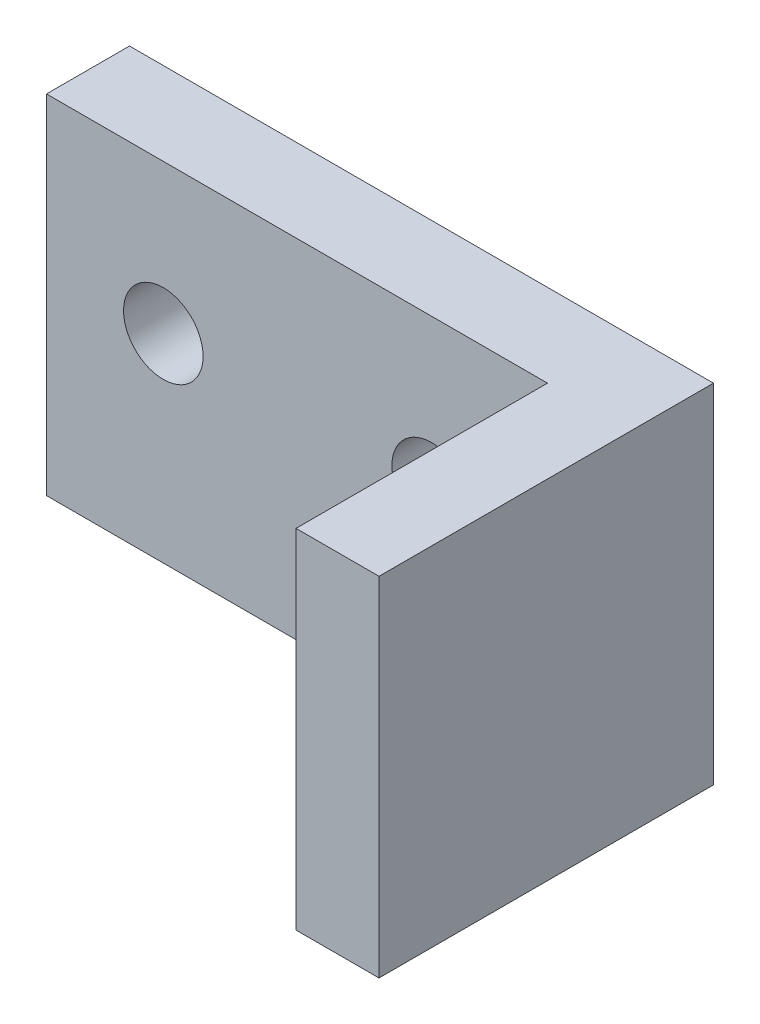
ISO-10303-21;
HEADER;
FILE_DESCRIPTION(('STEP AP214'),'2;1');
FILE_NAME('part.step','',(''),(''),'','','');
FILE_SCHEMA(('AUTOMOTIVE_DESIGN { 1 0 10303 214 1 1 1 1 }'));
ENDSEC;
DATA;
#1=APPLICATION_CONTEXT('core data for automotive mechanical design processes');
#2=APPLICATION_PROTOCOL_DEFINITION('international standard','automotive_design',2000,#1);
#3=PRODUCT_CONTEXT('',#1,'mechanical');
#4=PRODUCT('Part','Part','',(#3));
#5=PRODUCT_RELATED_PRODUCT_CATEGORY('part','',(#4));
#6=PRODUCT_DEFINITION_FORMATION('','',#4);
#7=PRODUCT_DEFINITION_CONTEXT('part definition',#1,'design');
#8=PRODUCT_DEFINITION('design','',#6,#7);
#9=PRODUCT_DEFINITION_SHAPE('','',#8);
#10=(LENGTH_UNIT() NAMED_UNIT(*) SI_UNIT(.MILLI.,.METRE.));
#11=(NAMED_UNIT(*) PLANE_ANGLE_UNIT() SI_UNIT($,.RADIAN.));
#12=(NAMED_UNIT(*) SI_UNIT($,.STERADIAN.) SOLID_ANGLE_UNIT());
#13=UNCERTAINTY_MEASURE_WITH_UNIT(LENGTH_MEASURE(1.E-05),#10,'distance_accuracy_value','');
#14=(GEOMETRIC_REPRESENTATION_CONTEXT(3) GLOBAL_UNCERTAINTY_ASSIGNED_CONTEXT((#13)) GLOBAL_UNIT_ASSIGNED_CONTEXT((#10,
#11,#12)) REPRESENTATION_CONTEXT('',''));
#15=CARTESIAN_POINT('',(0.,0.,0.));
#16=DIRECTION('',(0.,0.,1.));
#17=DIRECTION('',(1.,0.,0.));
#18=AXIS2_PLACEMENT_3D('',#15,#16,#17);
#19=CARTESIAN_POINT('',(25.15,205.,12.65));
#20=DIRECTION('',(1.,0.,0.));
#21=DIRECTION('',(0.,0.,-1.));
#22=AXIS2_PLACEMENT_3D('',#19,#20,#21);
#23=PLANE('',#22);
#24=DIRECTION('',(0.,0.,1.));
#25=VECTOR('',#24,1.);
#26=CARTESIAN_POINT('',(25.15,170.,12.65));
#27=LINE('',#26,#25);
#28=CARTESIAN_POINT('',(25.15,170.,-12.65));
#29=VERTEX_POINT('',#28);
#30=CARTESIAN_POINT('',(25.15,170.,12.65));
#31=VERTEX_POINT('',#30);
#32=EDGE_CURVE('E125',#29,#31,#27,.T.);
#33=ORIENTED_EDGE('',*,*,#32,.T.);
#34=DIRECTION('',(0.,-1.,0.));
#35=VECTOR('',#34,1.);
#36=CARTESIAN_POINT('',(25.15,205.,12.65));
#37=LINE('',#36,#35);
#38=CARTESIAN_POINT('',(25.15,205.,12.65));
#39=VERTEX_POINT('',#38);
#40=EDGE_CURVE('E11',#39,#31,#37,.T.);
#41=ORIENTED_EDGE('',*,*,#40,.F.);
#42=DIRECTION('',(0.,0.,1.));
#43=VECTOR('',#42,1.);
#44=CARTESIAN_POINT('',(25.15,205.,12.65));
#45=LINE('',#44,#43);
#46=CARTESIAN_POINT('',(25.15,205.,-12.65));
#47=VERTEX_POINT('',#46);
#48=EDGE_CURVE('E135',#47,#39,#45,.T.);
#49=ORIENTED_EDGE('',*,*,#48,.F.);
#50=DIRECTION('',(0.,-1.,0.));
#51=VECTOR('',#50,1.);
#52=CARTESIAN_POINT('',(25.15,205.,-12.65));
#53=LINE('',#52,#51);
#54=EDGE_CURVE('E121',#47,#29,#53,.T.);
#55=ORIENTED_EDGE('',*,*,#54,.T.);
#56=EDGE_LOOP('',(#33,#41,#49,#55));
#57=FACE_BOUND('',#56,.T.);
#58=ADVANCED_FACE('F39',(#57),#23,.F.);
#59=CARTESIAN_POINT('',(25.15,205.,12.65));
#60=DIRECTION('',(0.,0.,-1.));
#61=DIRECTION('',(-1.,0.,0.));
#62=AXIS2_PLACEMENT_3D('',#59,#60,#61);
#63=PLANE('',#62);
#64=DIRECTION('',(1.,0.,0.));
#65=VECTOR('',#64,1.);
#66=CARTESIAN_POINT('',(25.15,170.,12.65));
#67=LINE('',#66,#65);
#68=CARTESIAN_POINT('',(33.5,170.,12.65));
#69=VERTEX_POINT('',#68);
#70=EDGE_CURVE('E128',#31,#69,#67,.T.);
#71=ORIENTED_EDGE('',*,*,#70,.T.);
#72=DIRECTION('',(0.,-1.,0.));
#73=VECTOR('',#72,1.);
#74=CARTESIAN_POINT('',(33.5,205.,12.65));
#75=LINE('',#74,#73);
#76=CARTESIAN_POINT('',(33.5,205.,12.65));
#77=VERTEX_POINT('',#76);
#78=EDGE_CURVE('E48',#77,#69,#75,.T.);
#79=ORIENTED_EDGE('',*,*,#78,.F.);
#80=DIRECTION('',(1.,0.,0.));
#81=VECTOR('',#80,1.);
#82=CARTESIAN_POINT('',(25.15,205.,12.65));
#83=LINE('',#82,#81);
#84=EDGE_CURVE('E94',#39,#77,#83,.T.);
#85=ORIENTED_EDGE('',*,*,#84,.F.);
#86=ORIENTED_EDGE('',*,*,#40,.T.);
#87=EDGE_LOOP('',(#71,#79,#85,#86));
#88=FACE_BOUND('',#87,.T.);
#89=ADVANCED_FACE('F157',(#88),#63,.F.);
#90=CARTESIAN_POINT('',(33.5,205.,12.65));
#91=DIRECTION('',(-1.,0.,0.));
#92=DIRECTION('',(0.,0.,1.));
#93=AXIS2_PLACEMENT_3D('',#90,#91,#92);
#94=PLANE('',#93);
#95=DIRECTION('',(0.,0.,-1.));
#96=VECTOR('',#95,1.);
#97=CARTESIAN_POINT('',(33.5,170.,12.65));
#98=LINE('',#97,#96);
#99=CARTESIAN_POINT('',(33.5,170.,-21.));
#100=VERTEX_POINT('',#99);
#101=EDGE_CURVE('E130',#69,#100,#98,.T.);
#102=ORIENTED_EDGE('',*,*,#101,.T.);
#103=DIRECTION('',(0.,-1.,0.));
#104=VECTOR('',#103,1.);
#105=CARTESIAN_POINT('',(33.5,205.,-21.));
#106=LINE('',#105,#104);
#107=CARTESIAN_POINT('',(33.5,205.,-21.));
#108=VERTEX_POINT('',#107);
#109=EDGE_CURVE('E116',#108,#100,#106,.T.);
#110=ORIENTED_EDGE('',*,*,#109,.F.);
#111=DIRECTION('',(0.,0.,-1.));
#112=VECTOR('',#111,1.);
#113=CARTESIAN_POINT('',(33.5,205.,12.65));
#114=LINE('',#113,#112);
#115=EDGE_CURVE('E107',#77,#108,#114,.T.);
#116=ORIENTED_EDGE('',*,*,#115,.F.);
#117=ORIENTED_EDGE('',*,*,#78,.T.);
#118=EDGE_LOOP('',(#102,#110,#116,#117));
#119=FACE_BOUND('',#118,.T.);
#120=ADVANCED_FACE('F160',(#119),#94,.F.);
#121=CARTESIAN_POINT('',(33.5,205.,-21.));
#122=DIRECTION('',(0.,0.,1.));
#123=DIRECTION('',(1.,0.,0.));
#124=AXIS2_PLACEMENT_3D('',#121,#122,#123);
#125=PLANE('',#124);
#126=CARTESIAN_POINT('',(-13.5,190.,-21.));
#127=DIRECTION('',(0.,0.,1.));
#128=DIRECTION('',(1.,0.,0.));
#129=AXIS2_PLACEMENT_3D('',#126,#127,#128);
#130=CIRCLE('',#129,4.);
#131=CARTESIAN_POINT('',(-9.5,190.,-21.));
#132=VERTEX_POINT('',#131);
#133=EDGE_CURVE('E142',#132,#132,#130,.F.);
#134=ORIENTED_EDGE('',*,*,#133,.F.);
#135=EDGE_LOOP('',(#134));
#136=FACE_BOUND('',#135,.T.);
#137=CARTESIAN_POINT('',(13.5,190.,-21.));
#138=DIRECTION('',(0.,0.,1.));
#139=DIRECTION('',(1.,0.,0.));
#140=AXIS2_PLACEMENT_3D('',#137,#138,#139);
#141=CIRCLE('',#140,4.);
#142=CARTESIAN_POINT('',(17.5,190.,-21.));
#143=VERTEX_POINT('',#142);
#144=EDGE_CURVE('E147',#143,#143,#141,.F.);
#145=ORIENTED_EDGE('',*,*,#144,.F.);
#146=EDGE_LOOP('',(#145));
#147=FACE_BOUND('',#146,.T.);
#148=DIRECTION('',(-1.,0.,0.));
#149=VECTOR('',#148,1.);
#150=CARTESIAN_POINT('',(33.5,170.,-21.));
#151=LINE('',#150,#149);
#152=CARTESIAN_POINT('',(-25.25,170.,-21.));
#153=VERTEX_POINT('',#152);
#154=EDGE_CURVE('E115',#100,#153,#151,.T.);
#155=ORIENTED_EDGE('',*,*,#154,.T.);
#156=DIRECTION('',(0.,-1.,0.));
#157=VECTOR('',#156,1.);
#158=CARTESIAN_POINT('',(-25.25,205.,-21.));
#159=LINE('',#158,#157);
#160=CARTESIAN_POINT('',(-25.25,205.,-21.));
#161=VERTEX_POINT('',#160);
#162=EDGE_CURVE('E112',#161,#153,#159,.T.);
#163=ORIENTED_EDGE('',*,*,#162,.F.);
#164=DIRECTION('',(-1.,0.,0.));
#165=VECTOR('',#164,1.);
#166=CARTESIAN_POINT('',(33.5,205.,-21.));
#167=LINE('',#166,#165);
#168=EDGE_CURVE('E101',#108,#161,#167,.T.);
#169=ORIENTED_EDGE('',*,*,#168,.F.);
#170=ORIENTED_EDGE('',*,*,#109,.T.);
#171=EDGE_LOOP('',(#155,#163,#169,#170));
#172=FACE_BOUND('',#171,.T.);
#173=ADVANCED_FACE('F113',(#136,#147,#172),#125,.F.);
#174=CARTESIAN_POINT('',(-25.25,205.,-12.65));
#175=DIRECTION('',(1.,0.,0.));
#176=DIRECTION('',(0.,0.,-1.));
#177=AXIS2_PLACEMENT_3D('',#174,#175,#176);
#178=PLANE('',#177);
#179=DIRECTION('',(0.,0.,1.));
#180=VECTOR('',#179,1.);
#181=CARTESIAN_POINT('',(-25.25,170.,-12.65));
#182=LINE('',#181,#180);
#183=CARTESIAN_POINT('',(-25.25,170.,-12.65));
#184=VERTEX_POINT('',#183);
#185=EDGE_CURVE('E80',#153,#184,#182,.T.);
#186=ORIENTED_EDGE('',*,*,#185,.T.);
#187=DIRECTION('',(0.,-1.,0.));
#188=VECTOR('',#187,1.);
#189=CARTESIAN_POINT('',(-25.25,205.,-12.65));
#190=LINE('',#189,#188);
#191=CARTESIAN_POINT('',(-25.25,205.,-12.65));
#192=VERTEX_POINT('',#191);
#193=EDGE_CURVE('E117',#192,#184,#190,.T.);
#194=ORIENTED_EDGE('',*,*,#193,.F.);
#195=DIRECTION('',(0.,0.,1.));
#196=VECTOR('',#195,1.);
#197=CARTESIAN_POINT('',(-25.25,205.,-12.65));
#198=LINE('',#197,#196);
#199=EDGE_CURVE('E105',#161,#192,#198,.T.);
#200=ORIENTED_EDGE('',*,*,#199,.F.);
#201=ORIENTED_EDGE('',*,*,#162,.T.);
#202=EDGE_LOOP('',(#186,#194,#200,#201));
#203=FACE_BOUND('',#202,.T.);
#204=ADVANCED_FACE('F119',(#203),#178,.F.);
#205=CARTESIAN_POINT('',(25.15,205.,-12.65));
#206=DIRECTION('',(0.,0.,-1.));
#207=DIRECTION('',(-1.,0.,0.));
#208=AXIS2_PLACEMENT_3D('',#205,#206,#207);
#209=PLANE('',#208);
#210=CARTESIAN_POINT('',(-13.5,190.,-12.65));
#211=DIRECTION('',(0.,0.,-1.));
#212=DIRECTION('',(-1.,0.,0.));
#213=AXIS2_PLACEMENT_3D('',#210,#211,#212);
#214=CIRCLE('',#213,4.);
#215=CARTESIAN_POINT('',(-17.5,190.,-12.65));
#216=VERTEX_POINT('',#215);
#217=EDGE_CURVE('E42',#216,#216,#214,.T.);
#218=ORIENTED_EDGE('',*,*,#217,.T.);
#219=EDGE_LOOP('',(#218));
#220=FACE_BOUND('',#219,.T.);
#221=CARTESIAN_POINT('',(13.5,190.,-12.65));
#222=DIRECTION('',(0.,0.,-1.));
#223=DIRECTION('',(-1.,0.,0.));
#224=AXIS2_PLACEMENT_3D('',#221,#222,#223);
#225=CIRCLE('',#224,4.);
#226=CARTESIAN_POINT('',(9.5,190.,-12.65));
#227=VERTEX_POINT('',#226);
#228=EDGE_CURVE('E140',#227,#227,#225,.T.);
#229=ORIENTED_EDGE('',*,*,#228,.T.);
#230=EDGE_LOOP('',(#229));
#231=FACE_BOUND('',#230,.T.);
#232=DIRECTION('',(1.,0.,0.));
#233=VECTOR('',#232,1.);
#234=CARTESIAN_POINT('',(25.15,170.,-12.65));
#235=LINE('',#234,#233);
#236=EDGE_CURVE('E86',#184,#29,#235,.T.);
#237=ORIENTED_EDGE('',*,*,#236,.T.);
#238=ORIENTED_EDGE('',*,*,#54,.F.);
#239=DIRECTION('',(1.,0.,0.));
#240=VECTOR('',#239,1.);
#241=CARTESIAN_POINT('',(25.15,205.,-12.65));
#242=LINE('',#241,#240);
#243=EDGE_CURVE('E57',#192,#47,#242,.T.);
#244=ORIENTED_EDGE('',*,*,#243,.F.);
#245=ORIENTED_EDGE('',*,*,#193,.T.);
#246=EDGE_LOOP('',(#237,#238,#244,#245));
#247=FACE_BOUND('',#246,.T.);
#248=ADVANCED_FACE('F165',(#220,#231,#247),#209,.F.);
#249=CARTESIAN_POINT('',(0.,205.,0.));
#250=DIRECTION('',(0.,1.,0.));
#251=DIRECTION('',(0.,0.,1.));
#252=AXIS2_PLACEMENT_3D('',#249,#250,#251);
#253=PLANE('',#252);
#254=ORIENTED_EDGE('',*,*,#48,.T.);
#255=ORIENTED_EDGE('',*,*,#84,.T.);
#256=ORIENTED_EDGE('',*,*,#115,.T.);
#257=ORIENTED_EDGE('',*,*,#168,.T.);
#258=ORIENTED_EDGE('',*,*,#199,.T.);
#259=ORIENTED_EDGE('',*,*,#243,.T.);
#260=EDGE_LOOP('',(#254,#255,#256,#257,#258,#259));
#261=FACE_BOUND('',#260,.T.);
#262=ADVANCED_FACE('F103',(#261),#253,.T.);
#263=CARTESIAN_POINT('',(0.,170.,0.));
#264=DIRECTION('',(0.,1.,0.));
#265=DIRECTION('',(0.,0.,1.));
#266=AXIS2_PLACEMENT_3D('',#263,#264,#265);
#267=PLANE('',#266);
#268=ORIENTED_EDGE('',*,*,#32,.F.);
#269=ORIENTED_EDGE('',*,*,#236,.F.);
#270=ORIENTED_EDGE('',*,*,#185,.F.);
#271=ORIENTED_EDGE('',*,*,#154,.F.);
#272=ORIENTED_EDGE('',*,*,#101,.F.);
#273=ORIENTED_EDGE('',*,*,#70,.F.);
#274=EDGE_LOOP('',(#268,#269,#270,#271,#272,#273));
#275=FACE_BOUND('',#274,.T.);
#276=ADVANCED_FACE('F163',(#275),#267,.F.);
#277=CARTESIAN_POINT('',(13.5,190.,-32.3137084989848));
#278=DIRECTION('',(0.,0.,1.));
#279=DIRECTION('',(1.,0.,0.));
#280=AXIS2_PLACEMENT_3D('',#277,#278,#279);
#281=CYLINDRICAL_SURFACE('',#280,4.);
#282=ORIENTED_EDGE('',*,*,#144,.T.);
#283=EDGE_LOOP('',(#282));
#284=FACE_BOUND('',#283,.T.);
#285=ORIENTED_EDGE('',*,*,#228,.F.);
#286=EDGE_LOOP('',(#285));
#287=FACE_BOUND('',#286,.T.);
#288=ADVANCED_FACE('F194',(#284,#287),#281,.F.);
#289=CARTESIAN_POINT('',(-13.5,190.,-32.3137084989848));
#290=DIRECTION('',(0.,0.,1.));
#291=DIRECTION('',(1.,0.,0.));
#292=AXIS2_PLACEMENT_3D('',#289,#290,#291);
#293=CYLINDRICAL_SURFACE('',#292,4.);
#294=ORIENTED_EDGE('',*,*,#133,.T.);
#295=EDGE_LOOP('',(#294));
#296=FACE_BOUND('',#295,.T.);
#297=ORIENTED_EDGE('',*,*,#217,.F.);
#298=EDGE_LOOP('',(#297));
#299=FACE_BOUND('',#298,.T.);
#300=ADVANCED_FACE('F196',(#296,#299),#293,.F.);
#301=CLOSED_SHELL('',(#58,#89,#120,#173,#204,#248,#262,#276,#288,#300));
#302=MANIFOLD_SOLID_BREP('B2',#301);
#303=ADVANCED_BREP_SHAPE_REPRESENTATION('',(#18,#302),#14);
#304=SHAPE_DEFINITION_REPRESENTATION(#9,#303);
ENDSEC;
END-ISO-10303-21;
